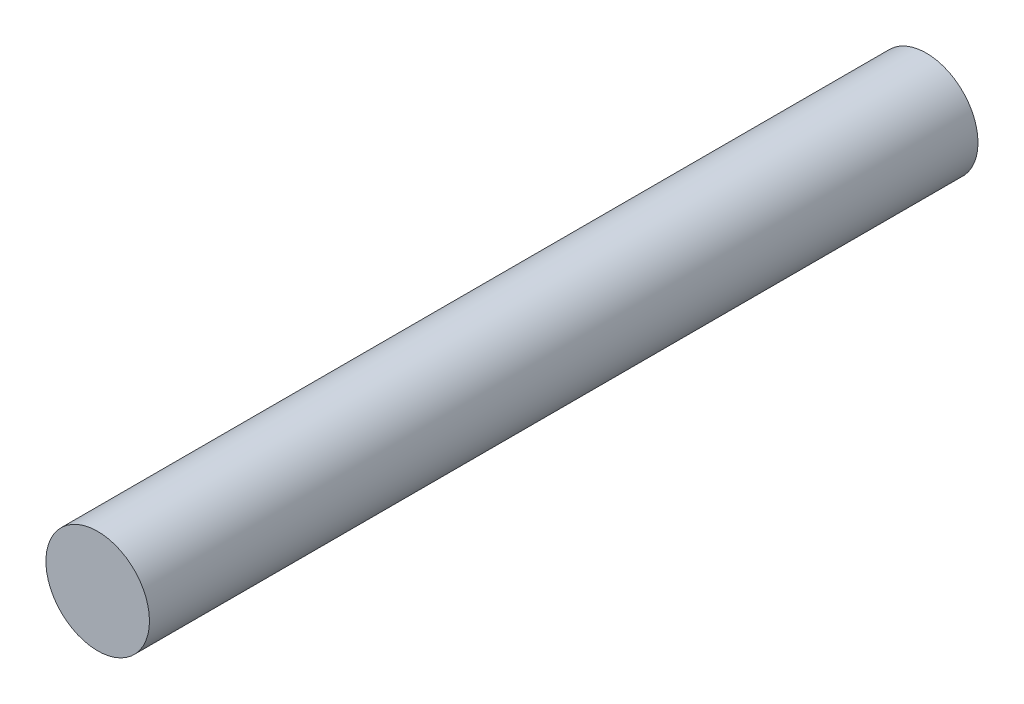
ISO-10303-21;
HEADER;
FILE_DESCRIPTION(('STEP AP214'),'2;1');
FILE_NAME('part.step','',(''),(''),'','','');
FILE_SCHEMA(('AUTOMOTIVE_DESIGN { 1 0 10303 214 1 1 1 1 }'));
ENDSEC;
DATA;
#1=APPLICATION_CONTEXT('core data for automotive mechanical design processes');
#2=APPLICATION_PROTOCOL_DEFINITION('international standard','automotive_design',2000,#1);
#3=PRODUCT_CONTEXT('',#1,'mechanical');
#4=PRODUCT('Part','Part','',(#3));
#5=PRODUCT_RELATED_PRODUCT_CATEGORY('part','',(#4));
#6=PRODUCT_DEFINITION_FORMATION('','',#4);
#7=PRODUCT_DEFINITION_CONTEXT('part definition',#1,'design');
#8=PRODUCT_DEFINITION('design','',#6,#7);
#9=PRODUCT_DEFINITION_SHAPE('','',#8);
#10=(LENGTH_UNIT() NAMED_UNIT(*) SI_UNIT(.MILLI.,.METRE.));
#11=(NAMED_UNIT(*) PLANE_ANGLE_UNIT() SI_UNIT($,.RADIAN.));
#12=(NAMED_UNIT(*) SI_UNIT($,.STERADIAN.) SOLID_ANGLE_UNIT());
#13=UNCERTAINTY_MEASURE_WITH_UNIT(LENGTH_MEASURE(1.E-05),#10,'distance_accuracy_value','');
#14=(GEOMETRIC_REPRESENTATION_CONTEXT(3) GLOBAL_UNCERTAINTY_ASSIGNED_CONTEXT((#13)) GLOBAL_UNIT_ASSIGNED_CONTEXT((#10,
#11,#12)) REPRESENTATION_CONTEXT('',''));
#15=CARTESIAN_POINT('',(0.,0.,0.));
#16=DIRECTION('',(0.,0.,1.));
#17=DIRECTION('',(1.,0.,0.));
#18=AXIS2_PLACEMENT_3D('',#15,#16,#17);
#19=CARTESIAN_POINT('',(0.,0.,50.8));
#20=DIRECTION('',(0.,0.,-1.));
#21=DIRECTION('',(-1.,0.,0.));
#22=AXIS2_PLACEMENT_3D('',#19,#20,#21);
#23=CYLINDRICAL_SURFACE('',#22,3.175);
#24=CARTESIAN_POINT('',(0.,0.,50.8));
#25=DIRECTION('',(0.,0.,1.));
#26=DIRECTION('',(1.,0.,0.));
#27=AXIS2_PLACEMENT_3D('',#24,#25,#26);
#28=CIRCLE('',#27,3.175);
#29=CARTESIAN_POINT('',(3.175,0.,50.8));
#30=VERTEX_POINT('',#29);
#31=EDGE_CURVE('E10',#30,#30,#28,.T.);
#32=ORIENTED_EDGE('',*,*,#31,.F.);
#33=EDGE_LOOP('',(#32));
#34=FACE_BOUND('',#33,.T.);
#35=CARTESIAN_POINT('',(0.,0.,0.));
#36=DIRECTION('',(0.,0.,1.));
#37=DIRECTION('',(1.,0.,0.));
#38=AXIS2_PLACEMENT_3D('',#35,#36,#37);
#39=CIRCLE('',#38,3.175);
#40=CARTESIAN_POINT('',(3.175,0.,0.));
#41=VERTEX_POINT('',#40);
#42=EDGE_CURVE('E44',#41,#41,#39,.T.);
#43=ORIENTED_EDGE('',*,*,#42,.T.);
#44=EDGE_LOOP('',(#43));
#45=FACE_BOUND('',#44,.T.);
#46=ADVANCED_FACE('F41',(#34,#45),#23,.T.);
#47=CARTESIAN_POINT('',(0.,0.,50.8));
#48=DIRECTION('',(0.,0.,1.));
#49=DIRECTION('',(1.,0.,0.));
#50=AXIS2_PLACEMENT_3D('',#47,#48,#49);
#51=PLANE('',#50);
#52=ORIENTED_EDGE('',*,*,#31,.T.);
#53=EDGE_LOOP('',(#52));
#54=FACE_BOUND('',#53,.T.);
#55=ADVANCED_FACE('F58',(#54),#51,.T.);
#56=CARTESIAN_POINT('',(0.,0.,0.));
#57=DIRECTION('',(0.,0.,1.));
#58=DIRECTION('',(1.,0.,0.));
#59=AXIS2_PLACEMENT_3D('',#56,#57,#58);
#60=PLANE('',#59);
#61=ORIENTED_EDGE('',*,*,#42,.F.);
#62=EDGE_LOOP('',(#61));
#63=FACE_BOUND('',#62,.T.);
#64=ADVANCED_FACE('F56',(#63),#60,.F.);
#65=CLOSED_SHELL('',(#46,#55,#64));
#66=MANIFOLD_SOLID_BREP('B2',#65);
#67=ADVANCED_BREP_SHAPE_REPRESENTATION('',(#18,#66),#14);
#68=SHAPE_DEFINITION_REPRESENTATION(#9,#67);
ENDSEC;
END-ISO-10303-21;
